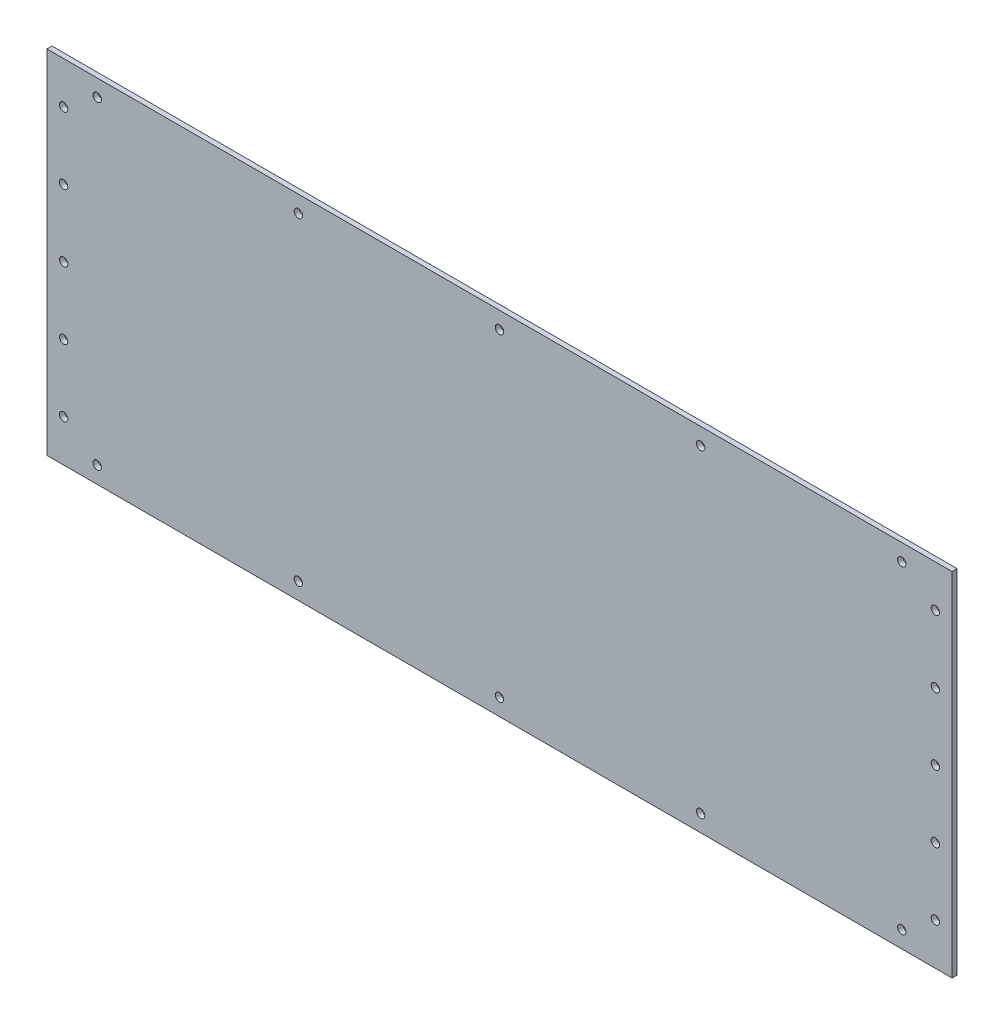
ISO-10303-21;
HEADER;
FILE_DESCRIPTION(('STEP AP214'),'2;1');
FILE_NAME('part.step','',(''),(''),'','','');
FILE_SCHEMA(('AUTOMOTIVE_DESIGN { 1 0 10303 214 1 1 1 1 }'));
ENDSEC;
DATA;
#1=APPLICATION_CONTEXT('core data for automotive mechanical design processes');
#2=APPLICATION_PROTOCOL_DEFINITION('international standard','automotive_design',2000,#1);
#3=PRODUCT_CONTEXT('',#1,'mechanical');
#4=PRODUCT('Part','Part','',(#3));
#5=PRODUCT_RELATED_PRODUCT_CATEGORY('part','',(#4));
#6=PRODUCT_DEFINITION_FORMATION('','',#4);
#7=PRODUCT_DEFINITION_CONTEXT('part definition',#1,'design');
#8=PRODUCT_DEFINITION('design','',#6,#7);
#9=PRODUCT_DEFINITION_SHAPE('','',#8);
#10=(LENGTH_UNIT() NAMED_UNIT(*) SI_UNIT(.MILLI.,.METRE.));
#11=(NAMED_UNIT(*) PLANE_ANGLE_UNIT() SI_UNIT($,.RADIAN.));
#12=(NAMED_UNIT(*) SI_UNIT($,.STERADIAN.) SOLID_ANGLE_UNIT());
#13=UNCERTAINTY_MEASURE_WITH_UNIT(LENGTH_MEASURE(1.E-05),#10,'distance_accuracy_value','');
#14=(GEOMETRIC_REPRESENTATION_CONTEXT(3) GLOBAL_UNCERTAINTY_ASSIGNED_CONTEXT((#13)) GLOBAL_UNIT_ASSIGNED_CONTEXT((#10,
#11,#12)) REPRESENTATION_CONTEXT('',''));
#15=CARTESIAN_POINT('',(0.,0.,0.));
#16=DIRECTION('',(0.,0.,1.));
#17=DIRECTION('',(1.,0.,0.));
#18=AXIS2_PLACEMENT_3D('',#15,#16,#17);
#19=CARTESIAN_POINT('',(270.,105.,3.));
#20=DIRECTION('',(-1.,0.,0.));
#21=DIRECTION('',(0.,0.,1.));
#22=AXIS2_PLACEMENT_3D('',#19,#20,#21);
#23=PLANE('',#22);
#24=DIRECTION('',(0.,1.,0.));
#25=VECTOR('',#24,1.);
#26=CARTESIAN_POINT('',(270.,105.,0.));
#27=LINE('',#26,#25);
#28=CARTESIAN_POINT('',(270.,-105.,0.));
#29=VERTEX_POINT('',#28);
#30=CARTESIAN_POINT('',(270.,105.,0.));
#31=VERTEX_POINT('',#30);
#32=EDGE_CURVE('E102',#29,#31,#27,.T.);
#33=ORIENTED_EDGE('',*,*,#32,.T.);
#34=DIRECTION('',(0.,0.,-1.));
#35=VECTOR('',#34,1.);
#36=CARTESIAN_POINT('',(270.,105.,3.));
#37=LINE('',#36,#35);
#38=CARTESIAN_POINT('',(270.,105.,3.));
#39=VERTEX_POINT('',#38);
#40=EDGE_CURVE('E11',#39,#31,#37,.T.);
#41=ORIENTED_EDGE('',*,*,#40,.F.);
#42=DIRECTION('',(0.,1.,0.));
#43=VECTOR('',#42,1.);
#44=CARTESIAN_POINT('',(270.,105.,3.));
#45=LINE('',#44,#43);
#46=CARTESIAN_POINT('',(270.,-105.,3.));
#47=VERTEX_POINT('',#46);
#48=EDGE_CURVE('E90',#47,#39,#45,.T.);
#49=ORIENTED_EDGE('',*,*,#48,.F.);
#50=DIRECTION('',(0.,0.,-1.));
#51=VECTOR('',#50,1.);
#52=CARTESIAN_POINT('',(270.,-105.,3.));
#53=LINE('',#52,#51);
#54=EDGE_CURVE('E98',#47,#29,#53,.T.);
#55=ORIENTED_EDGE('',*,*,#54,.T.);
#56=EDGE_LOOP('',(#33,#41,#49,#55));
#57=FACE_BOUND('',#56,.T.);
#58=ADVANCED_FACE('F39',(#57),#23,.F.);
#59=CARTESIAN_POINT('',(-270.,105.,3.));
#60=DIRECTION('',(0.,-1.,0.));
#61=DIRECTION('',(0.,0.,-1.));
#62=AXIS2_PLACEMENT_3D('',#59,#60,#61);
#63=PLANE('',#62);
#64=DIRECTION('',(-1.,0.,0.));
#65=VECTOR('',#64,1.);
#66=CARTESIAN_POINT('',(-270.,105.,0.));
#67=LINE('',#66,#65);
#68=CARTESIAN_POINT('',(-270.,105.,0.));
#69=VERTEX_POINT('',#68);
#70=EDGE_CURVE('E94',#31,#69,#67,.T.);
#71=ORIENTED_EDGE('',*,*,#70,.T.);
#72=DIRECTION('',(0.,0.,-1.));
#73=VECTOR('',#72,1.);
#74=CARTESIAN_POINT('',(-270.,105.,3.));
#75=LINE('',#74,#73);
#76=CARTESIAN_POINT('',(-270.,105.,3.));
#77=VERTEX_POINT('',#76);
#78=EDGE_CURVE('E47',#77,#69,#75,.T.);
#79=ORIENTED_EDGE('',*,*,#78,.F.);
#80=DIRECTION('',(-1.,0.,0.));
#81=VECTOR('',#80,1.);
#82=CARTESIAN_POINT('',(-270.,105.,3.));
#83=LINE('',#82,#81);
#84=EDGE_CURVE('E85',#39,#77,#83,.T.);
#85=ORIENTED_EDGE('',*,*,#84,.F.);
#86=ORIENTED_EDGE('',*,*,#40,.T.);
#87=EDGE_LOOP('',(#71,#79,#85,#86));
#88=FACE_BOUND('',#87,.T.);
#89=ADVANCED_FACE('F93',(#88),#63,.F.);
#90=CARTESIAN_POINT('',(-270.,105.,3.));
#91=DIRECTION('',(1.,0.,0.));
#92=DIRECTION('',(0.,0.,-1.));
#93=AXIS2_PLACEMENT_3D('',#90,#91,#92);
#94=PLANE('',#93);
#95=DIRECTION('',(0.,-1.,0.));
#96=VECTOR('',#95,1.);
#97=CARTESIAN_POINT('',(-270.,105.,0.));
#98=LINE('',#97,#96);
#99=CARTESIAN_POINT('',(-270.,-105.,0.));
#100=VERTEX_POINT('',#99);
#101=EDGE_CURVE('E72',#69,#100,#98,.T.);
#102=ORIENTED_EDGE('',*,*,#101,.T.);
#103=DIRECTION('',(0.,0.,-1.));
#104=VECTOR('',#103,1.);
#105=CARTESIAN_POINT('',(-270.,-105.,3.));
#106=LINE('',#105,#104);
#107=CARTESIAN_POINT('',(-270.,-105.,3.));
#108=VERTEX_POINT('',#107);
#109=EDGE_CURVE('E95',#108,#100,#106,.T.);
#110=ORIENTED_EDGE('',*,*,#109,.F.);
#111=DIRECTION('',(0.,-1.,0.));
#112=VECTOR('',#111,1.);
#113=CARTESIAN_POINT('',(-270.,105.,3.));
#114=LINE('',#113,#112);
#115=EDGE_CURVE('E88',#77,#108,#114,.T.);
#116=ORIENTED_EDGE('',*,*,#115,.F.);
#117=ORIENTED_EDGE('',*,*,#78,.T.);
#118=EDGE_LOOP('',(#102,#110,#116,#117));
#119=FACE_BOUND('',#118,.T.);
#120=ADVANCED_FACE('F96',(#119),#94,.F.);
#121=CARTESIAN_POINT('',(-270.,-105.,3.));
#122=DIRECTION('',(0.,1.,0.));
#123=DIRECTION('',(0.,0.,1.));
#124=AXIS2_PLACEMENT_3D('',#121,#122,#123);
#125=PLANE('',#124);
#126=DIRECTION('',(1.,0.,0.));
#127=VECTOR('',#126,1.);
#128=CARTESIAN_POINT('',(-270.,-105.,0.));
#129=LINE('',#128,#127);
#130=EDGE_CURVE('E78',#100,#29,#129,.T.);
#131=ORIENTED_EDGE('',*,*,#130,.T.);
#132=ORIENTED_EDGE('',*,*,#54,.F.);
#133=DIRECTION('',(1.,0.,0.));
#134=VECTOR('',#133,1.);
#135=CARTESIAN_POINT('',(-270.,-105.,3.));
#136=LINE('',#135,#134);
#137=EDGE_CURVE('E55',#108,#47,#136,.T.);
#138=ORIENTED_EDGE('',*,*,#137,.F.);
#139=ORIENTED_EDGE('',*,*,#109,.T.);
#140=EDGE_LOOP('',(#131,#132,#138,#139));
#141=FACE_BOUND('',#140,.T.);
#142=ADVANCED_FACE('F110',(#141),#125,.F.);
#143=CARTESIAN_POINT('',(0.,0.,3.));
#144=DIRECTION('',(0.,0.,1.));
#145=DIRECTION('',(1.,0.,0.));
#146=AXIS2_PLACEMENT_3D('',#143,#144,#145);
#147=PLANE('',#146);
#148=CARTESIAN_POINT('',(120.,-95.,3.));
#149=DIRECTION('',(0.,0.,1.));
#150=DIRECTION('',(1.,0.,0.));
#151=AXIS2_PLACEMENT_3D('',#148,#149,#150);
#152=CIRCLE('',#151,2.5);
#153=CARTESIAN_POINT('',(122.5,-95.,3.));
#154=VERTEX_POINT('',#153);
#155=EDGE_CURVE('E182',#154,#154,#152,.T.);
#156=ORIENTED_EDGE('',*,*,#155,.F.);
#157=EDGE_LOOP('',(#156));
#158=FACE_BOUND('',#157,.T.);
#159=CARTESIAN_POINT('',(-260.,80.,3.));
#160=DIRECTION('',(0.,0.,1.));
#161=DIRECTION('',(1.,0.,0.));
#162=AXIS2_PLACEMENT_3D('',#159,#160,#161);
#163=CIRCLE('',#162,2.50000000000002);
#164=CARTESIAN_POINT('',(-257.5,80.,3.));
#165=VERTEX_POINT('',#164);
#166=EDGE_CURVE('E189',#165,#165,#163,.T.);
#167=ORIENTED_EDGE('',*,*,#166,.F.);
#168=EDGE_LOOP('',(#167));
#169=FACE_BOUND('',#168,.T.);
#170=CARTESIAN_POINT('',(-260.,40.,3.));
#171=DIRECTION('',(0.,0.,1.));
#172=DIRECTION('',(1.,0.,0.));
#173=AXIS2_PLACEMENT_3D('',#170,#171,#172);
#174=CIRCLE('',#173,2.50000000000002);
#175=CARTESIAN_POINT('',(-257.5,40.,3.));
#176=VERTEX_POINT('',#175);
#177=EDGE_CURVE('E170',#176,#176,#174,.T.);
#178=ORIENTED_EDGE('',*,*,#177,.F.);
#179=EDGE_LOOP('',(#178));
#180=FACE_BOUND('',#179,.T.);
#181=CARTESIAN_POINT('',(-259.999999999999,-80.,3.));
#182=DIRECTION('',(0.,0.,1.));
#183=DIRECTION('',(1.,0.,0.));
#184=AXIS2_PLACEMENT_3D('',#181,#182,#183);
#185=CIRCLE('',#184,2.50000000000002);
#186=CARTESIAN_POINT('',(-257.499999999999,-80.,3.));
#187=VERTEX_POINT('',#186);
#188=EDGE_CURVE('E177',#187,#187,#185,.T.);
#189=ORIENTED_EDGE('',*,*,#188,.F.);
#190=EDGE_LOOP('',(#189));
#191=FACE_BOUND('',#190,.T.);
#192=CARTESIAN_POINT('',(260.,40.,3.));
#193=DIRECTION('',(0.,0.,1.));
#194=DIRECTION('',(1.,0.,0.));
#195=AXIS2_PLACEMENT_3D('',#192,#193,#194);
#196=CIRCLE('',#195,2.50000000000002);
#197=CARTESIAN_POINT('',(262.5,40.,3.));
#198=VERTEX_POINT('',#197);
#199=EDGE_CURVE('E206',#198,#198,#196,.T.);
#200=ORIENTED_EDGE('',*,*,#199,.F.);
#201=EDGE_LOOP('',(#200));
#202=FACE_BOUND('',#201,.T.);
#203=CARTESIAN_POINT('',(-240.,-95.0000000000017,3.));
#204=DIRECTION('',(0.,0.,1.));
#205=DIRECTION('',(1.,0.,0.));
#206=AXIS2_PLACEMENT_3D('',#203,#204,#205);
#207=CIRCLE('',#206,2.5);
#208=CARTESIAN_POINT('',(-237.5,-95.0000000000017,3.));
#209=VERTEX_POINT('',#208);
#210=EDGE_CURVE('E213',#209,#209,#207,.T.);
#211=ORIENTED_EDGE('',*,*,#210,.F.);
#212=EDGE_LOOP('',(#211));
#213=FACE_BOUND('',#212,.T.);
#214=CARTESIAN_POINT('',(-120.,-95.0000000000008,3.));
#215=DIRECTION('',(0.,0.,1.));
#216=DIRECTION('',(1.,0.,0.));
#217=AXIS2_PLACEMENT_3D('',#214,#215,#216);
#218=CIRCLE('',#217,2.5);
#219=CARTESIAN_POINT('',(-117.5,-95.0000000000008,3.));
#220=VERTEX_POINT('',#219);
#221=EDGE_CURVE('E194',#220,#220,#218,.T.);
#222=ORIENTED_EDGE('',*,*,#221,.F.);
#223=EDGE_LOOP('',(#222));
#224=FACE_BOUND('',#223,.T.);
#225=CARTESIAN_POINT('',(240.,-95.,3.));
#226=DIRECTION('',(0.,0.,1.));
#227=DIRECTION('',(1.,0.,0.));
#228=AXIS2_PLACEMENT_3D('',#225,#226,#227);
#229=CIRCLE('',#228,2.5);
#230=CARTESIAN_POINT('',(242.5,-95.,3.));
#231=VERTEX_POINT('',#230);
#232=EDGE_CURVE('E201',#231,#231,#229,.T.);
#233=ORIENTED_EDGE('',*,*,#232,.F.);
#234=EDGE_LOOP('',(#233));
#235=FACE_BOUND('',#234,.T.);
#236=CARTESIAN_POINT('',(-260.,0.,3.));
#237=DIRECTION('',(0.,0.,1.));
#238=DIRECTION('',(1.,0.,0.));
#239=AXIS2_PLACEMENT_3D('',#236,#237,#238);
#240=CIRCLE('',#239,2.50000000000002);
#241=CARTESIAN_POINT('',(-257.5,0.,3.));
#242=VERTEX_POINT('',#241);
#243=EDGE_CURVE('E141',#242,#242,#240,.T.);
#244=ORIENTED_EDGE('',*,*,#243,.F.);
#245=EDGE_LOOP('',(#244));
#246=FACE_BOUND('',#245,.T.);
#247=CARTESIAN_POINT('',(0.,-95.,3.));
#248=DIRECTION('',(0.,0.,1.));
#249=DIRECTION('',(1.,0.,0.));
#250=AXIS2_PLACEMENT_3D('',#247,#248,#249);
#251=CIRCLE('',#250,2.5);
#252=CARTESIAN_POINT('',(2.5,-95.,3.));
#253=VERTEX_POINT('',#252);
#254=EDGE_CURVE('E135',#253,#253,#251,.T.);
#255=ORIENTED_EDGE('',*,*,#254,.F.);
#256=EDGE_LOOP('',(#255));
#257=FACE_BOUND('',#256,.T.);
#258=CARTESIAN_POINT('',(260.,0.,3.));
#259=DIRECTION('',(0.,0.,1.));
#260=DIRECTION('',(1.,0.,0.));
#261=AXIS2_PLACEMENT_3D('',#258,#259,#260);
#262=CIRCLE('',#261,2.50000000000002);
#263=CARTESIAN_POINT('',(262.5,0.,3.));
#264=VERTEX_POINT('',#263);
#265=EDGE_CURVE('E129',#264,#264,#262,.T.);
#266=ORIENTED_EDGE('',*,*,#265,.F.);
#267=EDGE_LOOP('',(#266));
#268=FACE_BOUND('',#267,.T.);
#269=CARTESIAN_POINT('',(120.,95.,3.));
#270=DIRECTION('',(0.,0.,1.));
#271=DIRECTION('',(1.,0.,0.));
#272=AXIS2_PLACEMENT_3D('',#269,#270,#271);
#273=CIRCLE('',#272,2.5);
#274=CARTESIAN_POINT('',(122.5,95.,3.));
#275=VERTEX_POINT('',#274);
#276=EDGE_CURVE('E122',#275,#275,#273,.T.);
#277=ORIENTED_EDGE('',*,*,#276,.F.);
#278=EDGE_LOOP('',(#277));
#279=FACE_BOUND('',#278,.T.);
#280=CARTESIAN_POINT('',(240.,95.,3.));
#281=DIRECTION('',(0.,0.,1.));
#282=DIRECTION('',(1.,0.,0.));
#283=AXIS2_PLACEMENT_3D('',#280,#281,#282);
#284=CIRCLE('',#283,2.5);
#285=CARTESIAN_POINT('',(242.5,95.,3.));
#286=VERTEX_POINT('',#285);
#287=EDGE_CURVE('E165',#286,#286,#284,.T.);
#288=ORIENTED_EDGE('',*,*,#287,.F.);
#289=EDGE_LOOP('',(#288));
#290=FACE_BOUND('',#289,.T.);
#291=CARTESIAN_POINT('',(-120.,94.9999999999992,3.));
#292=DIRECTION('',(0.,0.,1.));
#293=DIRECTION('',(1.,0.,0.));
#294=AXIS2_PLACEMENT_3D('',#291,#292,#293);
#295=CIRCLE('',#294,2.5);
#296=CARTESIAN_POINT('',(-117.5,94.9999999999992,3.));
#297=VERTEX_POINT('',#296);
#298=EDGE_CURVE('E159',#297,#297,#295,.T.);
#299=ORIENTED_EDGE('',*,*,#298,.F.);
#300=EDGE_LOOP('',(#299));
#301=FACE_BOUND('',#300,.T.);
#302=CARTESIAN_POINT('',(-240.,94.9999999999983,3.));
#303=DIRECTION('',(0.,0.,1.));
#304=DIRECTION('',(1.,0.,0.));
#305=AXIS2_PLACEMENT_3D('',#302,#303,#304);
#306=CIRCLE('',#305,2.5);
#307=CARTESIAN_POINT('',(-237.5,94.9999999999983,3.));
#308=VERTEX_POINT('',#307);
#309=EDGE_CURVE('E153',#308,#308,#306,.T.);
#310=ORIENTED_EDGE('',*,*,#309,.F.);
#311=EDGE_LOOP('',(#310));
#312=FACE_BOUND('',#311,.T.);
#313=CARTESIAN_POINT('',(-259.999999999999,-40.,3.));
#314=DIRECTION('',(0.,0.,1.));
#315=DIRECTION('',(1.,0.,0.));
#316=AXIS2_PLACEMENT_3D('',#313,#314,#315);
#317=CIRCLE('',#316,2.50000000000002);
#318=CARTESIAN_POINT('',(-257.499999999999,-40.,3.));
#319=VERTEX_POINT('',#318);
#320=EDGE_CURVE('E146',#319,#319,#317,.T.);
#321=ORIENTED_EDGE('',*,*,#320,.F.);
#322=EDGE_LOOP('',(#321));
#323=FACE_BOUND('',#322,.T.);
#324=CARTESIAN_POINT('',(260.,80.,3.));
#325=DIRECTION('',(0.,0.,1.));
#326=DIRECTION('',(1.,0.,0.));
#327=AXIS2_PLACEMENT_3D('',#324,#325,#326);
#328=CIRCLE('',#327,2.50000000000002);
#329=CARTESIAN_POINT('',(262.5,80.,3.));
#330=VERTEX_POINT('',#329);
#331=EDGE_CURVE('E230',#330,#330,#328,.T.);
#332=ORIENTED_EDGE('',*,*,#331,.F.);
#333=EDGE_LOOP('',(#332));
#334=FACE_BOUND('',#333,.T.);
#335=CARTESIAN_POINT('',(260.,-40.,3.));
#336=DIRECTION('',(0.,0.,1.));
#337=DIRECTION('',(1.,0.,0.));
#338=AXIS2_PLACEMENT_3D('',#335,#336,#337);
#339=CIRCLE('',#338,2.50000000000002);
#340=CARTESIAN_POINT('',(262.5,-40.,3.));
#341=VERTEX_POINT('',#340);
#342=EDGE_CURVE('E224',#341,#341,#339,.T.);
#343=ORIENTED_EDGE('',*,*,#342,.F.);
#344=EDGE_LOOP('',(#343));
#345=FACE_BOUND('',#344,.T.);
#346=CARTESIAN_POINT('',(260.000000000001,-80.,3.));
#347=DIRECTION('',(0.,0.,1.));
#348=DIRECTION('',(1.,0.,0.));
#349=AXIS2_PLACEMENT_3D('',#346,#347,#348);
#350=CIRCLE('',#349,2.50000000000002);
#351=CARTESIAN_POINT('',(262.500000000001,-80.,3.));
#352=VERTEX_POINT('',#351);
#353=EDGE_CURVE('E218',#352,#352,#350,.T.);
#354=ORIENTED_EDGE('',*,*,#353,.F.);
#355=EDGE_LOOP('',(#354));
#356=FACE_BOUND('',#355,.T.);
#357=CARTESIAN_POINT('',(0.,95.,3.));
#358=DIRECTION('',(0.,0.,1.));
#359=DIRECTION('',(1.,0.,0.));
#360=AXIS2_PLACEMENT_3D('',#357,#358,#359);
#361=CIRCLE('',#360,2.5);
#362=CARTESIAN_POINT('',(2.5,95.,3.));
#363=VERTEX_POINT('',#362);
#364=EDGE_CURVE('E116',#363,#363,#361,.T.);
#365=ORIENTED_EDGE('',*,*,#364,.F.);
#366=EDGE_LOOP('',(#365));
#367=FACE_BOUND('',#366,.T.);
#368=ORIENTED_EDGE('',*,*,#48,.T.);
#369=ORIENTED_EDGE('',*,*,#84,.T.);
#370=ORIENTED_EDGE('',*,*,#115,.T.);
#371=ORIENTED_EDGE('',*,*,#137,.T.);
#372=EDGE_LOOP('',(#368,#369,#370,#371));
#373=FACE_BOUND('',#372,.T.);
#374=ADVANCED_FACE('F86',(#158,#169,#180,#191,#202,#213,#224,#235,#246,#257,#268,#279,#290,#301,
#312,#323,#334,#345,#356,#367,#373),#147,.T.);
#375=CARTESIAN_POINT('',(0.,0.,0.));
#376=DIRECTION('',(0.,0.,1.));
#377=DIRECTION('',(1.,0.,0.));
#378=AXIS2_PLACEMENT_3D('',#375,#376,#377);
#379=PLANE('',#378);
#380=CARTESIAN_POINT('',(120.,-95.,0.));
#381=DIRECTION('',(0.,0.,1.));
#382=DIRECTION('',(1.,0.,0.));
#383=AXIS2_PLACEMENT_3D('',#380,#381,#382);
#384=CIRCLE('',#383,2.5);
#385=CARTESIAN_POINT('',(122.5,-95.,0.));
#386=VERTEX_POINT('',#385);
#387=EDGE_CURVE('E185',#386,#386,#384,.T.);
#388=ORIENTED_EDGE('',*,*,#387,.T.);
#389=EDGE_LOOP('',(#388));
#390=FACE_BOUND('',#389,.T.);
#391=CARTESIAN_POINT('',(-260.,80.,0.));
#392=DIRECTION('',(0.,0.,1.));
#393=DIRECTION('',(1.,0.,0.));
#394=AXIS2_PLACEMENT_3D('',#391,#392,#393);
#395=CIRCLE('',#394,2.50000000000002);
#396=CARTESIAN_POINT('',(-257.5,80.,0.));
#397=VERTEX_POINT('',#396);
#398=EDGE_CURVE('E174',#397,#397,#395,.T.);
#399=ORIENTED_EDGE('',*,*,#398,.T.);
#400=EDGE_LOOP('',(#399));
#401=FACE_BOUND('',#400,.T.);
#402=CARTESIAN_POINT('',(-260.,40.,0.));
#403=DIRECTION('',(0.,0.,1.));
#404=DIRECTION('',(1.,0.,0.));
#405=AXIS2_PLACEMENT_3D('',#402,#403,#404);
#406=CIRCLE('',#405,2.50000000000002);
#407=CARTESIAN_POINT('',(-257.5,40.,0.));
#408=VERTEX_POINT('',#407);
#409=EDGE_CURVE('E173',#408,#408,#406,.T.);
#410=ORIENTED_EDGE('',*,*,#409,.T.);
#411=EDGE_LOOP('',(#410));
#412=FACE_BOUND('',#411,.T.);
#413=CARTESIAN_POINT('',(-259.999999999999,-80.,0.));
#414=DIRECTION('',(0.,0.,1.));
#415=DIRECTION('',(1.,0.,0.));
#416=AXIS2_PLACEMENT_3D('',#413,#414,#415);
#417=CIRCLE('',#416,2.50000000000002);
#418=CARTESIAN_POINT('',(-257.499999999999,-80.,0.));
#419=VERTEX_POINT('',#418);
#420=EDGE_CURVE('E150',#419,#419,#417,.T.);
#421=ORIENTED_EDGE('',*,*,#420,.T.);
#422=EDGE_LOOP('',(#421));
#423=FACE_BOUND('',#422,.T.);
#424=CARTESIAN_POINT('',(260.,40.,0.));
#425=DIRECTION('',(0.,0.,1.));
#426=DIRECTION('',(1.,0.,0.));
#427=AXIS2_PLACEMENT_3D('',#424,#425,#426);
#428=CIRCLE('',#427,2.50000000000002);
#429=CARTESIAN_POINT('',(262.5,40.,0.));
#430=VERTEX_POINT('',#429);
#431=EDGE_CURVE('E209',#430,#430,#428,.T.);
#432=ORIENTED_EDGE('',*,*,#431,.T.);
#433=EDGE_LOOP('',(#432));
#434=FACE_BOUND('',#433,.T.);
#435=CARTESIAN_POINT('',(-240.,-95.0000000000017,0.));
#436=DIRECTION('',(0.,0.,1.));
#437=DIRECTION('',(1.,0.,0.));
#438=AXIS2_PLACEMENT_3D('',#435,#436,#437);
#439=CIRCLE('',#438,2.5);
#440=CARTESIAN_POINT('',(-237.5,-95.0000000000017,0.));
#441=VERTEX_POINT('',#440);
#442=EDGE_CURVE('E198',#441,#441,#439,.T.);
#443=ORIENTED_EDGE('',*,*,#442,.T.);
#444=EDGE_LOOP('',(#443));
#445=FACE_BOUND('',#444,.T.);
#446=CARTESIAN_POINT('',(-120.,-95.0000000000008,0.));
#447=DIRECTION('',(0.,0.,1.));
#448=DIRECTION('',(1.,0.,0.));
#449=AXIS2_PLACEMENT_3D('',#446,#447,#448);
#450=CIRCLE('',#449,2.5);
#451=CARTESIAN_POINT('',(-117.5,-95.0000000000008,0.));
#452=VERTEX_POINT('',#451);
#453=EDGE_CURVE('E197',#452,#452,#450,.T.);
#454=ORIENTED_EDGE('',*,*,#453,.T.);
#455=EDGE_LOOP('',(#454));
#456=FACE_BOUND('',#455,.T.);
#457=CARTESIAN_POINT('',(240.,-95.,0.));
#458=DIRECTION('',(0.,0.,1.));
#459=DIRECTION('',(1.,0.,0.));
#460=AXIS2_PLACEMENT_3D('',#457,#458,#459);
#461=CIRCLE('',#460,2.5);
#462=CARTESIAN_POINT('',(242.5,-95.,0.));
#463=VERTEX_POINT('',#462);
#464=EDGE_CURVE('E186',#463,#463,#461,.T.);
#465=ORIENTED_EDGE('',*,*,#464,.T.);
#466=EDGE_LOOP('',(#465));
#467=FACE_BOUND('',#466,.T.);
#468=CARTESIAN_POINT('',(-260.,0.,0.));
#469=DIRECTION('',(0.,0.,1.));
#470=DIRECTION('',(1.,0.,0.));
#471=AXIS2_PLACEMENT_3D('',#468,#469,#470);
#472=CIRCLE('',#471,2.50000000000002);
#473=CARTESIAN_POINT('',(-257.5,0.,0.));
#474=VERTEX_POINT('',#473);
#475=EDGE_CURVE('E119',#474,#474,#472,.T.);
#476=ORIENTED_EDGE('',*,*,#475,.T.);
#477=EDGE_LOOP('',(#476));
#478=FACE_BOUND('',#477,.T.);
#479=CARTESIAN_POINT('',(0.,-95.,0.));
#480=DIRECTION('',(0.,0.,1.));
#481=DIRECTION('',(1.,0.,0.));
#482=AXIS2_PLACEMENT_3D('',#479,#480,#481);
#483=CIRCLE('',#482,2.5);
#484=CARTESIAN_POINT('',(2.5,-95.,0.));
#485=VERTEX_POINT('',#484);
#486=EDGE_CURVE('E138',#485,#485,#483,.T.);
#487=ORIENTED_EDGE('',*,*,#486,.T.);
#488=EDGE_LOOP('',(#487));
#489=FACE_BOUND('',#488,.T.);
#490=CARTESIAN_POINT('',(260.,0.,0.));
#491=DIRECTION('',(0.,0.,1.));
#492=DIRECTION('',(1.,0.,0.));
#493=AXIS2_PLACEMENT_3D('',#490,#491,#492);
#494=CIRCLE('',#493,2.50000000000002);
#495=CARTESIAN_POINT('',(262.5,0.,0.));
#496=VERTEX_POINT('',#495);
#497=EDGE_CURVE('E132',#496,#496,#494,.T.);
#498=ORIENTED_EDGE('',*,*,#497,.T.);
#499=EDGE_LOOP('',(#498));
#500=FACE_BOUND('',#499,.T.);
#501=CARTESIAN_POINT('',(120.,95.,0.));
#502=DIRECTION('',(0.,0.,1.));
#503=DIRECTION('',(1.,0.,0.));
#504=AXIS2_PLACEMENT_3D('',#501,#502,#503);
#505=CIRCLE('',#504,2.5);
#506=CARTESIAN_POINT('',(122.5,95.,0.));
#507=VERTEX_POINT('',#506);
#508=EDGE_CURVE('E125',#507,#507,#505,.T.);
#509=ORIENTED_EDGE('',*,*,#508,.T.);
#510=EDGE_LOOP('',(#509));
#511=FACE_BOUND('',#510,.T.);
#512=CARTESIAN_POINT('',(240.,95.,0.));
#513=DIRECTION('',(0.,0.,1.));
#514=DIRECTION('',(1.,0.,0.));
#515=AXIS2_PLACEMENT_3D('',#512,#513,#514);
#516=CIRCLE('',#515,2.5);
#517=CARTESIAN_POINT('',(242.5,95.,0.));
#518=VERTEX_POINT('',#517);
#519=EDGE_CURVE('E126',#518,#518,#516,.T.);
#520=ORIENTED_EDGE('',*,*,#519,.T.);
#521=EDGE_LOOP('',(#520));
#522=FACE_BOUND('',#521,.T.);
#523=CARTESIAN_POINT('',(-120.,94.9999999999992,0.));
#524=DIRECTION('',(0.,0.,1.));
#525=DIRECTION('',(1.,0.,0.));
#526=AXIS2_PLACEMENT_3D('',#523,#524,#525);
#527=CIRCLE('',#526,2.5);
#528=CARTESIAN_POINT('',(-117.5,94.9999999999992,0.));
#529=VERTEX_POINT('',#528);
#530=EDGE_CURVE('E162',#529,#529,#527,.T.);
#531=ORIENTED_EDGE('',*,*,#530,.T.);
#532=EDGE_LOOP('',(#531));
#533=FACE_BOUND('',#532,.T.);
#534=CARTESIAN_POINT('',(-240.,94.9999999999983,0.));
#535=DIRECTION('',(0.,0.,1.));
#536=DIRECTION('',(1.,0.,0.));
#537=AXIS2_PLACEMENT_3D('',#534,#535,#536);
#538=CIRCLE('',#537,2.5);
#539=CARTESIAN_POINT('',(-237.5,94.9999999999983,0.));
#540=VERTEX_POINT('',#539);
#541=EDGE_CURVE('E156',#540,#540,#538,.T.);
#542=ORIENTED_EDGE('',*,*,#541,.T.);
#543=EDGE_LOOP('',(#542));
#544=FACE_BOUND('',#543,.T.);
#545=CARTESIAN_POINT('',(-259.999999999999,-40.,0.));
#546=DIRECTION('',(0.,0.,1.));
#547=DIRECTION('',(1.,0.,0.));
#548=AXIS2_PLACEMENT_3D('',#545,#546,#547);
#549=CIRCLE('',#548,2.50000000000002);
#550=CARTESIAN_POINT('',(-257.499999999999,-40.,0.));
#551=VERTEX_POINT('',#550);
#552=EDGE_CURVE('E149',#551,#551,#549,.T.);
#553=ORIENTED_EDGE('',*,*,#552,.T.);
#554=EDGE_LOOP('',(#553));
#555=FACE_BOUND('',#554,.T.);
#556=CARTESIAN_POINT('',(260.,80.,0.));
#557=DIRECTION('',(0.,0.,1.));
#558=DIRECTION('',(1.,0.,0.));
#559=AXIS2_PLACEMENT_3D('',#556,#557,#558);
#560=CIRCLE('',#559,2.50000000000002);
#561=CARTESIAN_POINT('',(262.5,80.,0.));
#562=VERTEX_POINT('',#561);
#563=EDGE_CURVE('E210',#562,#562,#560,.T.);
#564=ORIENTED_EDGE('',*,*,#563,.T.);
#565=EDGE_LOOP('',(#564));
#566=FACE_BOUND('',#565,.T.);
#567=CARTESIAN_POINT('',(260.,-40.,0.));
#568=DIRECTION('',(0.,0.,1.));
#569=DIRECTION('',(1.,0.,0.));
#570=AXIS2_PLACEMENT_3D('',#567,#568,#569);
#571=CIRCLE('',#570,2.50000000000002);
#572=CARTESIAN_POINT('',(262.5,-40.,0.));
#573=VERTEX_POINT('',#572);
#574=EDGE_CURVE('E227',#573,#573,#571,.T.);
#575=ORIENTED_EDGE('',*,*,#574,.T.);
#576=EDGE_LOOP('',(#575));
#577=FACE_BOUND('',#576,.T.);
#578=CARTESIAN_POINT('',(260.000000000001,-80.,0.));
#579=DIRECTION('',(0.,0.,1.));
#580=DIRECTION('',(1.,0.,0.));
#581=AXIS2_PLACEMENT_3D('',#578,#579,#580);
#582=CIRCLE('',#581,2.50000000000002);
#583=CARTESIAN_POINT('',(262.500000000001,-80.,0.));
#584=VERTEX_POINT('',#583);
#585=EDGE_CURVE('E221',#584,#584,#582,.T.);
#586=ORIENTED_EDGE('',*,*,#585,.T.);
#587=EDGE_LOOP('',(#586));
#588=FACE_BOUND('',#587,.T.);
#589=CARTESIAN_POINT('',(0.,95.,0.));
#590=DIRECTION('',(0.,0.,1.));
#591=DIRECTION('',(1.,0.,0.));
#592=AXIS2_PLACEMENT_3D('',#589,#590,#591);
#593=CIRCLE('',#592,2.5);
#594=CARTESIAN_POINT('',(2.5,95.,0.));
#595=VERTEX_POINT('',#594);
#596=EDGE_CURVE('E105',#595,#595,#593,.T.);
#597=ORIENTED_EDGE('',*,*,#596,.T.);
#598=EDGE_LOOP('',(#597));
#599=FACE_BOUND('',#598,.T.);
#600=ORIENTED_EDGE('',*,*,#32,.F.);
#601=ORIENTED_EDGE('',*,*,#130,.F.);
#602=ORIENTED_EDGE('',*,*,#101,.F.);
#603=ORIENTED_EDGE('',*,*,#70,.F.);
#604=EDGE_LOOP('',(#600,#601,#602,#603));
#605=FACE_BOUND('',#604,.T.);
#606=ADVANCED_FACE('F113',(#390,#401,#412,#423,#434,#445,#456,#467,#478,#489,#500,#511,#522,
#533,#544,#555,#566,#577,#588,#599,#605),#379,.F.);
#607=CARTESIAN_POINT('',(0.,95.,0.));
#608=DIRECTION('',(0.,0.,1.));
#609=DIRECTION('',(1.,0.,0.));
#610=AXIS2_PLACEMENT_3D('',#607,#608,#609);
#611=CYLINDRICAL_SURFACE('',#610,2.5);
#612=ORIENTED_EDGE('',*,*,#596,.F.);
#613=EDGE_LOOP('',(#612));
#614=FACE_BOUND('',#613,.T.);
#615=ORIENTED_EDGE('',*,*,#364,.T.);
#616=EDGE_LOOP('',(#615));
#617=FACE_BOUND('',#616,.T.);
#618=ADVANCED_FACE('F256',(#614,#617),#611,.F.);
#619=CARTESIAN_POINT('',(260.000000000001,-80.,0.));
#620=DIRECTION('',(0.,0.,1.));
#621=DIRECTION('',(1.,0.,0.));
#622=AXIS2_PLACEMENT_3D('',#619,#620,#621);
#623=CYLINDRICAL_SURFACE('',#622,2.50000000000002);
#624=ORIENTED_EDGE('',*,*,#585,.F.);
#625=EDGE_LOOP('',(#624));
#626=FACE_BOUND('',#625,.T.);
#627=ORIENTED_EDGE('',*,*,#353,.T.);
#628=EDGE_LOOP('',(#627));
#629=FACE_BOUND('',#628,.T.);
#630=ADVANCED_FACE('F258',(#626,#629),#623,.F.);
#631=CARTESIAN_POINT('',(260.,-40.,0.));
#632=DIRECTION('',(0.,0.,1.));
#633=DIRECTION('',(1.,0.,0.));
#634=AXIS2_PLACEMENT_3D('',#631,#632,#633);
#635=CYLINDRICAL_SURFACE('',#634,2.50000000000002);
#636=ORIENTED_EDGE('',*,*,#574,.F.);
#637=EDGE_LOOP('',(#636));
#638=FACE_BOUND('',#637,.T.);
#639=ORIENTED_EDGE('',*,*,#342,.T.);
#640=EDGE_LOOP('',(#639));
#641=FACE_BOUND('',#640,.T.);
#642=ADVANCED_FACE('F242',(#638,#641),#635,.F.);
#643=CARTESIAN_POINT('',(260.,80.,0.));
#644=DIRECTION('',(0.,0.,1.));
#645=DIRECTION('',(1.,0.,0.));
#646=AXIS2_PLACEMENT_3D('',#643,#644,#645);
#647=CYLINDRICAL_SURFACE('',#646,2.50000000000002);
#648=ORIENTED_EDGE('',*,*,#563,.F.);
#649=EDGE_LOOP('',(#648));
#650=FACE_BOUND('',#649,.T.);
#651=ORIENTED_EDGE('',*,*,#331,.T.);
#652=EDGE_LOOP('',(#651));
#653=FACE_BOUND('',#652,.T.);
#654=ADVANCED_FACE('F238',(#650,#653),#647,.F.);
#655=CARTESIAN_POINT('',(-259.999999999999,-40.,0.));
#656=DIRECTION('',(0.,0.,1.));
#657=DIRECTION('',(1.,0.,0.));
#658=AXIS2_PLACEMENT_3D('',#655,#656,#657);
#659=CYLINDRICAL_SURFACE('',#658,2.50000000000002);
#660=ORIENTED_EDGE('',*,*,#552,.F.);
#661=EDGE_LOOP('',(#660));
#662=FACE_BOUND('',#661,.T.);
#663=ORIENTED_EDGE('',*,*,#320,.T.);
#664=EDGE_LOOP('',(#663));
#665=FACE_BOUND('',#664,.T.);
#666=ADVANCED_FACE('F241',(#662,#665),#659,.F.);
#667=CARTESIAN_POINT('',(-240.,94.9999999999983,0.));
#668=DIRECTION('',(0.,0.,1.));
#669=DIRECTION('',(1.,0.,0.));
#670=AXIS2_PLACEMENT_3D('',#667,#668,#669);
#671=CYLINDRICAL_SURFACE('',#670,2.5);
#672=ORIENTED_EDGE('',*,*,#541,.F.);
#673=EDGE_LOOP('',(#672));
#674=FACE_BOUND('',#673,.T.);
#675=ORIENTED_EDGE('',*,*,#309,.T.);
#676=EDGE_LOOP('',(#675));
#677=FACE_BOUND('',#676,.T.);
#678=ADVANCED_FACE('F327',(#674,#677),#671,.F.);
#679=CARTESIAN_POINT('',(-120.,94.9999999999992,0.));
#680=DIRECTION('',(0.,0.,1.));
#681=DIRECTION('',(1.,0.,0.));
#682=AXIS2_PLACEMENT_3D('',#679,#680,#681);
#683=CYLINDRICAL_SURFACE('',#682,2.5);
#684=ORIENTED_EDGE('',*,*,#530,.F.);
#685=EDGE_LOOP('',(#684));
#686=FACE_BOUND('',#685,.T.);
#687=ORIENTED_EDGE('',*,*,#298,.T.);
#688=EDGE_LOOP('',(#687));
#689=FACE_BOUND('',#688,.T.);
#690=ADVANCED_FACE('F337',(#686,#689),#683,.F.);
#691=CARTESIAN_POINT('',(240.,95.,0.));
#692=DIRECTION('',(0.,0.,1.));
#693=DIRECTION('',(1.,0.,0.));
#694=AXIS2_PLACEMENT_3D('',#691,#692,#693);
#695=CYLINDRICAL_SURFACE('',#694,2.5);
#696=ORIENTED_EDGE('',*,*,#519,.F.);
#697=EDGE_LOOP('',(#696));
#698=FACE_BOUND('',#697,.T.);
#699=ORIENTED_EDGE('',*,*,#287,.T.);
#700=EDGE_LOOP('',(#699));
#701=FACE_BOUND('',#700,.T.);
#702=ADVANCED_FACE('F347',(#698,#701),#695,.F.);
#703=CARTESIAN_POINT('',(120.,95.,0.));
#704=DIRECTION('',(0.,0.,1.));
#705=DIRECTION('',(1.,0.,0.));
#706=AXIS2_PLACEMENT_3D('',#703,#704,#705);
#707=CYLINDRICAL_SURFACE('',#706,2.5);
#708=ORIENTED_EDGE('',*,*,#508,.F.);
#709=EDGE_LOOP('',(#708));
#710=FACE_BOUND('',#709,.T.);
#711=ORIENTED_EDGE('',*,*,#276,.T.);
#712=EDGE_LOOP('',(#711));
#713=FACE_BOUND('',#712,.T.);
#714=ADVANCED_FACE('F357',(#710,#713),#707,.F.);
#715=CARTESIAN_POINT('',(260.,0.,0.));
#716=DIRECTION('',(0.,0.,1.));
#717=DIRECTION('',(1.,0.,0.));
#718=AXIS2_PLACEMENT_3D('',#715,#716,#717);
#719=CYLINDRICAL_SURFACE('',#718,2.50000000000002);
#720=ORIENTED_EDGE('',*,*,#497,.F.);
#721=EDGE_LOOP('',(#720));
#722=FACE_BOUND('',#721,.T.);
#723=ORIENTED_EDGE('',*,*,#265,.T.);
#724=EDGE_LOOP('',(#723));
#725=FACE_BOUND('',#724,.T.);
#726=ADVANCED_FACE('F367',(#722,#725),#719,.F.);
#727=CARTESIAN_POINT('',(0.,-95.,0.));
#728=DIRECTION('',(0.,0.,1.));
#729=DIRECTION('',(1.,0.,0.));
#730=AXIS2_PLACEMENT_3D('',#727,#728,#729);
#731=CYLINDRICAL_SURFACE('',#730,2.5);
#732=ORIENTED_EDGE('',*,*,#486,.F.);
#733=EDGE_LOOP('',(#732));
#734=FACE_BOUND('',#733,.T.);
#735=ORIENTED_EDGE('',*,*,#254,.T.);
#736=EDGE_LOOP('',(#735));
#737=FACE_BOUND('',#736,.T.);
#738=ADVANCED_FACE('F376',(#734,#737),#731,.F.);
#739=CARTESIAN_POINT('',(-260.,0.,0.));
#740=DIRECTION('',(0.,0.,1.));
#741=DIRECTION('',(1.,0.,0.));
#742=AXIS2_PLACEMENT_3D('',#739,#740,#741);
#743=CYLINDRICAL_SURFACE('',#742,2.50000000000002);
#744=ORIENTED_EDGE('',*,*,#475,.F.);
#745=EDGE_LOOP('',(#744));
#746=FACE_BOUND('',#745,.T.);
#747=ORIENTED_EDGE('',*,*,#243,.T.);
#748=EDGE_LOOP('',(#747));
#749=FACE_BOUND('',#748,.T.);
#750=ADVANCED_FACE('F386',(#746,#749),#743,.F.);
#751=CARTESIAN_POINT('',(240.,-95.,0.));
#752=DIRECTION('',(0.,0.,1.));
#753=DIRECTION('',(1.,0.,0.));
#754=AXIS2_PLACEMENT_3D('',#751,#752,#753);
#755=CYLINDRICAL_SURFACE('',#754,2.5);
#756=ORIENTED_EDGE('',*,*,#464,.F.);
#757=EDGE_LOOP('',(#756));
#758=FACE_BOUND('',#757,.T.);
#759=ORIENTED_EDGE('',*,*,#232,.T.);
#760=EDGE_LOOP('',(#759));
#761=FACE_BOUND('',#760,.T.);
#762=ADVANCED_FACE('F396',(#758,#761),#755,.F.);
#763=CARTESIAN_POINT('',(-120.,-95.0000000000008,0.));
#764=DIRECTION('',(0.,0.,1.));
#765=DIRECTION('',(1.,0.,0.));
#766=AXIS2_PLACEMENT_3D('',#763,#764,#765);
#767=CYLINDRICAL_SURFACE('',#766,2.5);
#768=ORIENTED_EDGE('',*,*,#453,.F.);
#769=EDGE_LOOP('',(#768));
#770=FACE_BOUND('',#769,.T.);
#771=ORIENTED_EDGE('',*,*,#221,.T.);
#772=EDGE_LOOP('',(#771));
#773=FACE_BOUND('',#772,.T.);
#774=ADVANCED_FACE('F406',(#770,#773),#767,.F.);
#775=CARTESIAN_POINT('',(-240.,-95.0000000000017,0.));
#776=DIRECTION('',(0.,0.,1.));
#777=DIRECTION('',(1.,0.,0.));
#778=AXIS2_PLACEMENT_3D('',#775,#776,#777);
#779=CYLINDRICAL_SURFACE('',#778,2.5);
#780=ORIENTED_EDGE('',*,*,#442,.F.);
#781=EDGE_LOOP('',(#780));
#782=FACE_BOUND('',#781,.T.);
#783=ORIENTED_EDGE('',*,*,#210,.T.);
#784=EDGE_LOOP('',(#783));
#785=FACE_BOUND('',#784,.T.);
#786=ADVANCED_FACE('F416',(#782,#785),#779,.F.);
#787=CARTESIAN_POINT('',(260.,40.,0.));
#788=DIRECTION('',(0.,0.,1.));
#789=DIRECTION('',(1.,0.,0.));
#790=AXIS2_PLACEMENT_3D('',#787,#788,#789);
#791=CYLINDRICAL_SURFACE('',#790,2.50000000000002);
#792=ORIENTED_EDGE('',*,*,#431,.F.);
#793=EDGE_LOOP('',(#792));
#794=FACE_BOUND('',#793,.T.);
#795=ORIENTED_EDGE('',*,*,#199,.T.);
#796=EDGE_LOOP('',(#795));
#797=FACE_BOUND('',#796,.T.);
#798=ADVANCED_FACE('F426',(#794,#797),#791,.F.);
#799=CARTESIAN_POINT('',(-259.999999999999,-80.,0.));
#800=DIRECTION('',(0.,0.,1.));
#801=DIRECTION('',(1.,0.,0.));
#802=AXIS2_PLACEMENT_3D('',#799,#800,#801);
#803=CYLINDRICAL_SURFACE('',#802,2.50000000000002);
#804=ORIENTED_EDGE('',*,*,#420,.F.);
#805=EDGE_LOOP('',(#804));
#806=FACE_BOUND('',#805,.T.);
#807=ORIENTED_EDGE('',*,*,#188,.T.);
#808=EDGE_LOOP('',(#807));
#809=FACE_BOUND('',#808,.T.);
#810=ADVANCED_FACE('F436',(#806,#809),#803,.F.);
#811=CARTESIAN_POINT('',(-260.,40.,0.));
#812=DIRECTION('',(0.,0.,1.));
#813=DIRECTION('',(1.,0.,0.));
#814=AXIS2_PLACEMENT_3D('',#811,#812,#813);
#815=CYLINDRICAL_SURFACE('',#814,2.50000000000002);
#816=ORIENTED_EDGE('',*,*,#409,.F.);
#817=EDGE_LOOP('',(#816));
#818=FACE_BOUND('',#817,.T.);
#819=ORIENTED_EDGE('',*,*,#177,.T.);
#820=EDGE_LOOP('',(#819));
#821=FACE_BOUND('',#820,.T.);
#822=ADVANCED_FACE('F446',(#818,#821),#815,.F.);
#823=CARTESIAN_POINT('',(-260.,80.,0.));
#824=DIRECTION('',(0.,0.,1.));
#825=DIRECTION('',(1.,0.,0.));
#826=AXIS2_PLACEMENT_3D('',#823,#824,#825);
#827=CYLINDRICAL_SURFACE('',#826,2.50000000000002);
#828=ORIENTED_EDGE('',*,*,#398,.F.);
#829=EDGE_LOOP('',(#828));
#830=FACE_BOUND('',#829,.T.);
#831=ORIENTED_EDGE('',*,*,#166,.T.);
#832=EDGE_LOOP('',(#831));
#833=FACE_BOUND('',#832,.T.);
#834=ADVANCED_FACE('F456',(#830,#833),#827,.F.);
#835=CARTESIAN_POINT('',(120.,-95.,0.));
#836=DIRECTION('',(0.,0.,1.));
#837=DIRECTION('',(1.,0.,0.));
#838=AXIS2_PLACEMENT_3D('',#835,#836,#837);
#839=CYLINDRICAL_SURFACE('',#838,2.5);
#840=ORIENTED_EDGE('',*,*,#387,.F.);
#841=EDGE_LOOP('',(#840));
#842=FACE_BOUND('',#841,.T.);
#843=ORIENTED_EDGE('',*,*,#155,.T.);
#844=EDGE_LOOP('',(#843));
#845=FACE_BOUND('',#844,.T.);
#846=ADVANCED_FACE('F466',(#842,#845),#839,.F.);
#847=CLOSED_SHELL('',(#58,#89,#120,#142,#374,#606,#618,#630,#642,#654,#666,#678,#690,#702,#714,
#726,#738,#750,#762,#774,#786,#798,#810,#822,#834,#846));
#848=MANIFOLD_SOLID_BREP('B2',#847);
#849=ADVANCED_BREP_SHAPE_REPRESENTATION('',(#18,#848),#14);
#850=SHAPE_DEFINITION_REPRESENTATION(#9,#849);
ENDSEC;
END-ISO-10303-21;
